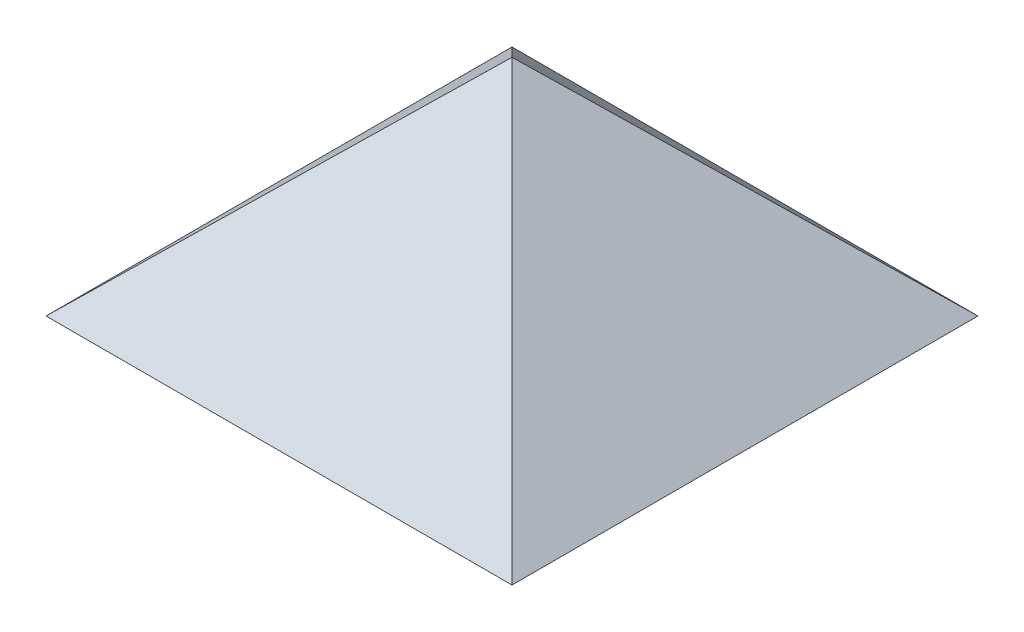
ISO-10303-21;
HEADER;
FILE_DESCRIPTION(('STEP AP214'),'2;1');
FILE_NAME('part.step','',(''),(''),'','','');
FILE_SCHEMA(('AUTOMOTIVE_DESIGN { 1 0 10303 214 1 1 1 1 }'));
ENDSEC;
DATA;
#1=APPLICATION_CONTEXT('core data for automotive mechanical design processes');
#2=APPLICATION_PROTOCOL_DEFINITION('international standard','automotive_design',2000,#1);
#3=PRODUCT_CONTEXT('',#1,'mechanical');
#4=PRODUCT('Part','Part','',(#3));
#5=PRODUCT_RELATED_PRODUCT_CATEGORY('part','',(#4));
#6=PRODUCT_DEFINITION_FORMATION('','',#4);
#7=PRODUCT_DEFINITION_CONTEXT('part definition',#1,'design');
#8=PRODUCT_DEFINITION('design','',#6,#7);
#9=PRODUCT_DEFINITION_SHAPE('','',#8);
#10=(LENGTH_UNIT() NAMED_UNIT(*) SI_UNIT(.MILLI.,.METRE.));
#11=(NAMED_UNIT(*) PLANE_ANGLE_UNIT() SI_UNIT($,.RADIAN.));
#12=(NAMED_UNIT(*) SI_UNIT($,.STERADIAN.) SOLID_ANGLE_UNIT());
#13=UNCERTAINTY_MEASURE_WITH_UNIT(LENGTH_MEASURE(1.E-05),#10,'distance_accuracy_value','');
#14=(GEOMETRIC_REPRESENTATION_CONTEXT(3) GLOBAL_UNCERTAINTY_ASSIGNED_CONTEXT((#13)) GLOBAL_UNIT_ASSIGNED_CONTEXT((#10,
#11,#12)) REPRESENTATION_CONTEXT('',''));
#15=CARTESIAN_POINT('',(0.,0.,0.));
#16=DIRECTION('',(0.,0.,1.));
#17=DIRECTION('',(1.,0.,0.));
#18=AXIS2_PLACEMENT_3D('',#15,#16,#17);
#19=CARTESIAN_POINT('',(624.519600307456,649.500384319754,-3.69052085842322E-13));
#20=DIRECTION('',(0.693108716251784,0.720833064901856,0.));
#21=DIRECTION('',(-0.720833064901856,0.693108716251785,0.));
#22=AXIS2_PLACEMENT_3D('',#19,#20,#21);
#23=PLANE('',#22);
#24=DIRECTION('',(0.584749707598187,-0.562259334229027,-0.584749707598188));
#25=VECTOR('',#24,1.);
#26=CARTESIAN_POINT('',(0.,1250.,0.));
#27=LINE('',#26,#25);
#28=CARTESIAN_POINT('',(0.,1250.,0.));
#29=VERTEX_POINT('',#28);
#30=CARTESIAN_POINT('',(1300.,0.,-1300.));
#31=VERTEX_POINT('',#30);
#32=EDGE_CURVE('E168',#29,#31,#27,.T.);
#33=ORIENTED_EDGE('',*,*,#32,.F.);
#34=DIRECTION('',(-0.584749707598188,0.562259334229026,-0.584749707598188));
#35=VECTOR('',#34,1.);
#36=CARTESIAN_POINT('',(0.,1250.,0.));
#37=LINE('',#36,#35);
#38=CARTESIAN_POINT('',(1300.,4.44089209850063E-13,1300.));
#39=VERTEX_POINT('',#38);
#40=EDGE_CURVE('E13',#39,#29,#37,.T.);
#41=ORIENTED_EDGE('',*,*,#40,.F.);
#42=DIRECTION('',(0.,0.,1.));
#43=VECTOR('',#42,1.);
#44=CARTESIAN_POINT('',(1300.,0.,-1300.));
#45=LINE('',#44,#43);
#46=EDGE_CURVE('E82',#31,#39,#45,.T.);
#47=ORIENTED_EDGE('',*,*,#46,.F.);
#48=EDGE_LOOP('',(#33,#41,#47));
#49=FACE_BOUND('',#48,.T.);
#50=ADVANCED_FACE('F72',(#49),#23,.T.);
#51=CARTESIAN_POINT('',(583.279479338394,606.61065851193,-2.46201249697577E-13));
#52=DIRECTION('',(0.693108716251785,0.720833064901856,0.));
#53=DIRECTION('',(-0.720833064901856,0.693108716251785,0.));
#54=AXIS2_PLACEMENT_3D('',#51,#52,#53);
#55=PLANE('',#54);
#56=DIRECTION('',(0.584749707598187,-0.562259334229027,-0.584749707598188));
#57=VECTOR('',#56,1.);
#58=CARTESIAN_POINT('',(0.,1167.45631172192,0.));
#59=LINE('',#58,#57);
#60=CARTESIAN_POINT('',(0.,1167.45631172192,0.));
#61=VERTEX_POINT('',#60);
#62=CARTESIAN_POINT('',(1214.1545641908,2.22044604925031E-13,-1214.1545641908));
#63=VERTEX_POINT('',#62);
#64=EDGE_CURVE('E131',#61,#63,#59,.T.);
#65=ORIENTED_EDGE('',*,*,#64,.T.);
#66=DIRECTION('',(0.,0.,1.));
#67=VECTOR('',#66,1.);
#68=CARTESIAN_POINT('',(1214.1545641908,1.11022302462516E-13,1214.1545641908));
#69=LINE('',#68,#67);
#70=CARTESIAN_POINT('',(1214.1545641908,0.,1214.1545641908));
#71=VERTEX_POINT('',#70);
#72=EDGE_CURVE('E115',#63,#71,#69,.T.);
#73=ORIENTED_EDGE('',*,*,#72,.T.);
#74=DIRECTION('',(-0.584749707598188,0.562259334229027,-0.584749707598187));
#75=VECTOR('',#74,1.);
#76=CARTESIAN_POINT('',(0.,1167.45631172192,0.));
#77=LINE('',#76,#75);
#78=EDGE_CURVE('E120',#71,#61,#77,.T.);
#79=ORIENTED_EDGE('',*,*,#78,.T.);
#80=EDGE_LOOP('',(#65,#73,#79));
#81=FACE_BOUND('',#80,.T.);
#82=ADVANCED_FACE('F130',(#81),#55,.F.);
#83=CARTESIAN_POINT('',(0.,0.,0.));
#84=DIRECTION('',(-0.707106781186548,0.,0.707106781186547));
#85=DIRECTION('',(0.707106781186547,0.,0.707106781186548));
#86=AXIS2_PLACEMENT_3D('',#83,#84,#85);
#87=PLANE('',#86);
#88=DIRECTION('',(0.707106781186547,0.,0.707106781186548));
#89=VECTOR('',#88,1.);
#90=CARTESIAN_POINT('',(1214.1545641908,0.,1214.1545641908));
#91=LINE('',#90,#89);
#92=EDGE_CURVE('E110',#71,#39,#91,.T.);
#93=ORIENTED_EDGE('',*,*,#92,.T.);
#94=ORIENTED_EDGE('',*,*,#40,.T.);
#95=DIRECTION('',(0.,1.,0.));
#96=VECTOR('',#95,1.);
#97=CARTESIAN_POINT('',(0.,1167.45631172192,0.));
#98=LINE('',#97,#96);
#99=EDGE_CURVE('E97',#61,#29,#98,.T.);
#100=ORIENTED_EDGE('',*,*,#99,.F.);
#101=ORIENTED_EDGE('',*,*,#78,.F.);
#102=EDGE_LOOP('',(#93,#94,#100,#101));
#103=FACE_BOUND('',#102,.T.);
#104=ADVANCED_FACE('F123',(#103),#87,.T.);
#105=CARTESIAN_POINT('',(-2.22044604925031E-13,0.,-2.22044604925031E-13));
#106=DIRECTION('',(-0.707106781186548,0.,-0.707106781186548));
#107=DIRECTION('',(-0.707106781186548,0.,0.707106781186548));
#108=AXIS2_PLACEMENT_3D('',#105,#106,#107);
#109=PLANE('',#108);
#110=ORIENTED_EDGE('',*,*,#99,.T.);
#111=ORIENTED_EDGE('',*,*,#32,.T.);
#112=DIRECTION('',(0.707106781186548,0.,-0.707106781186548));
#113=VECTOR('',#112,1.);
#114=CARTESIAN_POINT('',(1214.1545641908,2.22044604925031E-13,-1214.1545641908));
#115=LINE('',#114,#113);
#116=EDGE_CURVE('E184',#63,#31,#115,.T.);
#117=ORIENTED_EDGE('',*,*,#116,.F.);
#118=ORIENTED_EDGE('',*,*,#64,.F.);
#119=EDGE_LOOP('',(#110,#111,#117,#118));
#120=FACE_BOUND('',#119,.T.);
#121=ADVANCED_FACE('F198',(#120),#109,.T.);
#122=CARTESIAN_POINT('',(0.,-6.28097389179493E-12,0.));
#123=DIRECTION('',(0.,-1.,0.));
#124=DIRECTION('',(0.,0.,-1.));
#125=AXIS2_PLACEMENT_3D('',#122,#123,#124);
#126=PLANE('',#125);
#127=ORIENTED_EDGE('',*,*,#116,.T.);
#128=ORIENTED_EDGE('',*,*,#46,.T.);
#129=ORIENTED_EDGE('',*,*,#92,.F.);
#130=ORIENTED_EDGE('',*,*,#72,.F.);
#131=EDGE_LOOP('',(#127,#128,#129,#130));
#132=FACE_BOUND('',#131,.T.);
#133=ADVANCED_FACE('F113',(#132),#126,.T.);
#134=CLOSED_SHELL('',(#50,#82,#104,#121,#133));
#135=MANIFOLD_SOLID_BREP('B2',#134);
#136=CARTESIAN_POINT('',(-2.63608632744516E-13,649.500384319754,-624.519600307456));
#137=DIRECTION('',(0.,-0.720833064901856,0.693108716251784));
#138=DIRECTION('',(0.,-0.693108716251784,-0.720833064901856));
#139=AXIS2_PLACEMENT_3D('',#136,#137,#138);
#140=PLANE('',#139);
#141=DIRECTION('',(0.584749707598187,-0.562259334229027,-0.584749707598188));
#142=VECTOR('',#141,1.);
#143=CARTESIAN_POINT('',(0.,1250.,0.));
#144=LINE('',#143,#142);
#145=CARTESIAN_POINT('',(0.,1250.,0.));
#146=VERTEX_POINT('',#145);
#147=CARTESIAN_POINT('',(1300.,4.44089209850063E-13,-1300.));
#148=VERTEX_POINT('',#147);
#149=EDGE_CURVE('E380',#146,#148,#144,.T.);
#150=ORIENTED_EDGE('',*,*,#149,.T.);
#151=DIRECTION('',(-1.,0.,0.));
#152=VECTOR('',#151,1.);
#153=CARTESIAN_POINT('',(-1300.,0.,-1300.));
#154=LINE('',#153,#152);
#155=CARTESIAN_POINT('',(-1300.,2.22044604925031E-13,-1300.));
#156=VERTEX_POINT('',#155);
#157=EDGE_CURVE('E327',#148,#156,#154,.T.);
#158=ORIENTED_EDGE('',*,*,#157,.T.);
#159=DIRECTION('',(0.584749707598188,0.562259334229027,0.584749707598187));
#160=VECTOR('',#159,1.);
#161=CARTESIAN_POINT('',(0.,1250.,0.));
#162=LINE('',#161,#160);
#163=EDGE_CURVE('E70',#156,#146,#162,.T.);
#164=ORIENTED_EDGE('',*,*,#163,.T.);
#165=EDGE_LOOP('',(#150,#158,#164));
#166=FACE_BOUND('',#165,.T.);
#167=ADVANCED_FACE('F317',(#166),#140,.F.);
#168=CARTESIAN_POINT('',(-1.96960999758062E-13,606.61065851193,-583.279479338394));
#169=DIRECTION('',(0.,-0.720833064901856,0.693108716251784));
#170=DIRECTION('',(0.,-0.693108716251784,-0.720833064901856));
#171=AXIS2_PLACEMENT_3D('',#168,#169,#170);
#172=PLANE('',#171);
#173=DIRECTION('',(0.584749707598187,-0.562259334229027,-0.584749707598188));
#174=VECTOR('',#173,1.);
#175=CARTESIAN_POINT('',(0.,1167.45631172192,0.));
#176=LINE('',#175,#174);
#177=CARTESIAN_POINT('',(0.,1167.45631172192,0.));
#178=VERTEX_POINT('',#177);
#179=CARTESIAN_POINT('',(1214.1545641908,7.77156117237609E-13,-1214.1545641908));
#180=VERTEX_POINT('',#179);
#181=EDGE_CURVE('E362',#178,#180,#176,.T.);
#182=ORIENTED_EDGE('',*,*,#181,.F.);
#183=DIRECTION('',(0.584749707598188,0.562259334229027,0.584749707598187));
#184=VECTOR('',#183,1.);
#185=CARTESIAN_POINT('',(0.,1167.45631172192,0.));
#186=LINE('',#185,#184);
#187=CARTESIAN_POINT('',(-1214.1545641908,0.,-1214.1545641908));
#188=VERTEX_POINT('',#187);
#189=EDGE_CURVE('E356',#188,#178,#186,.T.);
#190=ORIENTED_EDGE('',*,*,#189,.F.);
#191=DIRECTION('',(-1.,0.,0.));
#192=VECTOR('',#191,1.);
#193=CARTESIAN_POINT('',(1214.1545641908,7.7715611723761E-13,-1214.1545641908));
#194=LINE('',#193,#192);
#195=EDGE_CURVE('E359',#180,#188,#194,.T.);
#196=ORIENTED_EDGE('',*,*,#195,.F.);
#197=EDGE_LOOP('',(#182,#190,#196));
#198=FACE_BOUND('',#197,.T.);
#199=ADVANCED_FACE('F358',(#198),#172,.T.);
#200=CARTESIAN_POINT('',(0.,0.,0.));
#201=DIRECTION('',(0.707106781186543,0.,0.707106781186552));
#202=DIRECTION('',(0.707106781186552,0.,-0.707106781186543));
#203=AXIS2_PLACEMENT_3D('',#200,#201,#202);
#204=PLANE('',#203);
#205=DIRECTION('',(0.707106781186552,0.,-0.707106781186543));
#206=VECTOR('',#205,1.);
#207=CARTESIAN_POINT('',(1214.1545641908,7.77156117237609E-13,-1214.1545641908));
#208=LINE('',#207,#206);
#209=EDGE_CURVE('E367',#180,#148,#208,.T.);
#210=ORIENTED_EDGE('',*,*,#209,.T.);
#211=ORIENTED_EDGE('',*,*,#149,.F.);
#212=DIRECTION('',(0.,1.,0.));
#213=VECTOR('',#212,1.);
#214=CARTESIAN_POINT('',(0.,1167.45631172192,0.));
#215=LINE('',#214,#213);
#216=EDGE_CURVE('E381',#178,#146,#215,.T.);
#217=ORIENTED_EDGE('',*,*,#216,.F.);
#218=ORIENTED_EDGE('',*,*,#181,.T.);
#219=EDGE_LOOP('',(#210,#211,#217,#218));
#220=FACE_BOUND('',#219,.T.);
#221=ADVANCED_FACE('F400',(#220),#204,.T.);
#222=CARTESIAN_POINT('',(-2.22044604925031E-13,0.,2.22044604925031E-13));
#223=DIRECTION('',(-0.707106781186548,0.,0.707106781186548));
#224=DIRECTION('',(0.707106781186548,0.,0.707106781186548));
#225=AXIS2_PLACEMENT_3D('',#222,#223,#224);
#226=PLANE('',#225);
#227=ORIENTED_EDGE('',*,*,#216,.T.);
#228=ORIENTED_EDGE('',*,*,#163,.F.);
#229=DIRECTION('',(-0.707106781186548,0.,-0.707106781186548));
#230=VECTOR('',#229,1.);
#231=CARTESIAN_POINT('',(-1214.1545641908,0.,-1214.1545641908));
#232=LINE('',#231,#230);
#233=EDGE_CURVE('E342',#188,#156,#232,.T.);
#234=ORIENTED_EDGE('',*,*,#233,.F.);
#235=ORIENTED_EDGE('',*,*,#189,.T.);
#236=EDGE_LOOP('',(#227,#228,#234,#235));
#237=FACE_BOUND('',#236,.T.);
#238=ADVANCED_FACE('F378',(#237),#226,.T.);
#239=CARTESIAN_POINT('',(0.,1.17688604278788E-11,0.));
#240=DIRECTION('',(0.,-1.,0.));
#241=DIRECTION('',(1.,0.,0.));
#242=AXIS2_PLACEMENT_3D('',#239,#240,#241);
#243=PLANE('',#242);
#244=ORIENTED_EDGE('',*,*,#233,.T.);
#245=ORIENTED_EDGE('',*,*,#157,.F.);
#246=ORIENTED_EDGE('',*,*,#209,.F.);
#247=ORIENTED_EDGE('',*,*,#195,.T.);
#248=EDGE_LOOP('',(#244,#245,#246,#247));
#249=FACE_BOUND('',#248,.T.);
#250=ADVANCED_FACE('F373',(#249),#243,.T.);
#251=CLOSED_SHELL('',(#167,#199,#221,#238,#250));
#252=MANIFOLD_SOLID_BREP('B7',#251);
#253=CARTESIAN_POINT('',(-624.519600307456,649.500384319754,2.63608632744516E-13));
#254=DIRECTION('',(0.693108716251785,-0.720833064901856,0.));
#255=DIRECTION('',(0.720833064901856,0.693108716251785,0.));
#256=AXIS2_PLACEMENT_3D('',#253,#254,#255);
#257=PLANE('',#256);
#258=DIRECTION('',(0.584749707598188,0.562259334229027,0.584749707598187));
#259=VECTOR('',#258,1.);
#260=CARTESIAN_POINT('',(0.,1250.,0.));
#261=LINE('',#260,#259);
#262=CARTESIAN_POINT('',(-1300.,0.,-1300.));
#263=VERTEX_POINT('',#262);
#264=CARTESIAN_POINT('',(0.,1250.,0.));
#265=VERTEX_POINT('',#264);
#266=EDGE_CURVE('E625',#263,#265,#261,.T.);
#267=ORIENTED_EDGE('',*,*,#266,.F.);
#268=DIRECTION('',(0.,0.,-1.));
#269=VECTOR('',#268,1.);
#270=CARTESIAN_POINT('',(-1300.,0.,-1300.));
#271=LINE('',#270,#269);
#272=CARTESIAN_POINT('',(-1300.,0.,1300.));
#273=VERTEX_POINT('',#272);
#274=EDGE_CURVE('E315',#273,#263,#271,.T.);
#275=ORIENTED_EDGE('',*,*,#274,.F.);
#276=DIRECTION('',(-0.584749707598187,-0.562259334229027,0.584749707598188));
#277=VECTOR('',#276,1.);
#278=CARTESIAN_POINT('',(0.,1250.,0.));
#279=LINE('',#278,#277);
#280=EDGE_CURVE('E571',#265,#273,#279,.T.);
#281=ORIENTED_EDGE('',*,*,#280,.F.);
#282=EDGE_LOOP('',(#267,#275,#281));
#283=FACE_BOUND('',#282,.T.);
#284=ADVANCED_FACE('F561',(#283),#257,.F.);
#285=CARTESIAN_POINT('',(-583.279479338394,606.61065851193,2.46201249697577E-13));
#286=DIRECTION('',(0.693108716251785,-0.720833064901856,0.));
#287=DIRECTION('',(0.720833064901856,0.693108716251785,0.));
#288=AXIS2_PLACEMENT_3D('',#285,#286,#287);
#289=PLANE('',#288);
#290=DIRECTION('',(-0.584749707598188,-0.562259334229027,-0.584749707598187));
#291=VECTOR('',#290,1.);
#292=CARTESIAN_POINT('',(0.,1167.45631172192,0.));
#293=LINE('',#292,#291);
#294=CARTESIAN_POINT('',(-2.22044604925031E-13,1167.45631172192,2.22044604925031E-13));
#295=VERTEX_POINT('',#294);
#296=CARTESIAN_POINT('',(-1214.1545641908,-1.11022302462516E-13,-1214.1545641908));
#297=VERTEX_POINT('',#296);
#298=EDGE_CURVE('E606',#295,#297,#293,.T.);
#299=ORIENTED_EDGE('',*,*,#298,.F.);
#300=DIRECTION('',(0.584749707598187,0.562259334229027,-0.584749707598188));
#301=VECTOR('',#300,1.);
#302=CARTESIAN_POINT('',(-1214.1545641908,0.,1214.1545641908));
#303=LINE('',#302,#301);
#304=CARTESIAN_POINT('',(-1214.1545641908,0.,1214.1545641908));
#305=VERTEX_POINT('',#304);
#306=EDGE_CURVE('E600',#305,#295,#303,.T.);
#307=ORIENTED_EDGE('',*,*,#306,.F.);
#308=DIRECTION('',(0.,0.,1.));
#309=VECTOR('',#308,1.);
#310=CARTESIAN_POINT('',(-1214.1545641908,-1.11022302462516E-13,-1214.1545641908));
#311=LINE('',#310,#309);
#312=EDGE_CURVE('E604',#297,#305,#311,.T.);
#313=ORIENTED_EDGE('',*,*,#312,.F.);
#314=EDGE_LOOP('',(#299,#307,#313));
#315=FACE_BOUND('',#314,.T.);
#316=ADVANCED_FACE('F603',(#315),#289,.T.);
#317=CARTESIAN_POINT('',(-3.45932946020533E-12,0.,3.45932946020532E-12));
#318=DIRECTION('',(0.707106781186548,0.,-0.707106781186547));
#319=DIRECTION('',(-0.707106781186547,0.,-0.707106781186548));
#320=AXIS2_PLACEMENT_3D('',#317,#318,#319);
#321=PLANE('',#320);
#322=DIRECTION('',(-0.707106781186547,0.,-0.707106781186548));
#323=VECTOR('',#322,1.);
#324=CARTESIAN_POINT('',(-1214.1545641908,-1.11022302462516E-13,-1214.1545641908));
#325=LINE('',#324,#323);
#326=EDGE_CURVE('E586',#297,#263,#325,.T.);
#327=ORIENTED_EDGE('',*,*,#326,.T.);
#328=ORIENTED_EDGE('',*,*,#266,.T.);
#329=DIRECTION('',(0.,1.,0.));
#330=VECTOR('',#329,1.);
#331=CARTESIAN_POINT('',(-2.22044604925031E-13,1167.45631172192,2.22044604925031E-13));
#332=LINE('',#331,#330);
#333=EDGE_CURVE('E626',#295,#265,#332,.T.);
#334=ORIENTED_EDGE('',*,*,#333,.F.);
#335=ORIENTED_EDGE('',*,*,#298,.T.);
#336=EDGE_LOOP('',(#327,#328,#334,#335));
#337=FACE_BOUND('',#336,.T.);
#338=ADVANCED_FACE('F644',(#337),#321,.T.);
#339=CARTESIAN_POINT('',(2.22044604925031E-12,0.,2.22044604925032E-12));
#340=DIRECTION('',(0.707106781186547,0.,0.707106781186548));
#341=DIRECTION('',(0.707106781186548,0.,-0.707106781186547));
#342=AXIS2_PLACEMENT_3D('',#339,#340,#341);
#343=PLANE('',#342);
#344=ORIENTED_EDGE('',*,*,#333,.T.);
#345=ORIENTED_EDGE('',*,*,#280,.T.);
#346=DIRECTION('',(-0.707106781186548,0.,0.707106781186547));
#347=VECTOR('',#346,1.);
#348=CARTESIAN_POINT('',(-1214.1545641908,0.,1214.1545641908));
#349=LINE('',#348,#347);
#350=EDGE_CURVE('E619',#305,#273,#349,.T.);
#351=ORIENTED_EDGE('',*,*,#350,.F.);
#352=ORIENTED_EDGE('',*,*,#306,.T.);
#353=EDGE_LOOP('',(#344,#345,#351,#352));
#354=FACE_BOUND('',#353,.T.);
#355=ADVANCED_FACE('F623',(#354),#343,.T.);
#356=CARTESIAN_POINT('',(0.,-1.68126577541126E-12,0.));
#357=DIRECTION('',(0.,-1.,0.));
#358=DIRECTION('',(0.,0.,-1.));
#359=AXIS2_PLACEMENT_3D('',#356,#357,#358);
#360=PLANE('',#359);
#361=ORIENTED_EDGE('',*,*,#350,.T.);
#362=ORIENTED_EDGE('',*,*,#274,.T.);
#363=ORIENTED_EDGE('',*,*,#326,.F.);
#364=ORIENTED_EDGE('',*,*,#312,.T.);
#365=EDGE_LOOP('',(#361,#362,#363,#364));
#366=FACE_BOUND('',#365,.T.);
#367=ADVANCED_FACE('F618',(#366),#360,.T.);
#368=CLOSED_SHELL('',(#284,#316,#338,#355,#367));
#369=MANIFOLD_SOLID_BREP('B64',#368);
#370=CARTESIAN_POINT('',(1.96960999758062E-13,606.61065851193,583.279479338394));
#371=DIRECTION('',(0.,-0.720833064901856,-0.693108716251784));
#372=DIRECTION('',(0.,0.693108716251784,-0.720833064901856));
#373=AXIS2_PLACEMENT_3D('',#370,#371,#372);
#374=PLANE('',#373);
#375=DIRECTION('',(0.584749707598187,0.562259334229027,-0.584749707598188));
#376=VECTOR('',#375,1.);
#377=CARTESIAN_POINT('',(-1214.1545641908,0.,1214.1545641908));
#378=LINE('',#377,#376);
#379=CARTESIAN_POINT('',(-1214.1545641908,0.,1214.1545641908));
#380=VERTEX_POINT('',#379);
#381=CARTESIAN_POINT('',(0.,1167.45631172192,0.));
#382=VERTEX_POINT('',#381);
#383=EDGE_CURVE('E894',#380,#382,#378,.T.);
#384=ORIENTED_EDGE('',*,*,#383,.T.);
#385=DIRECTION('',(0.584749707598188,-0.562259334229027,0.584749707598187));
#386=VECTOR('',#385,1.);
#387=CARTESIAN_POINT('',(0.,1167.45631172192,0.));
#388=LINE('',#387,#386);
#389=CARTESIAN_POINT('',(1214.1545641908,0.,1214.1545641908));
#390=VERTEX_POINT('',#389);
#391=EDGE_CURVE('E806',#382,#390,#388,.T.);
#392=ORIENTED_EDGE('',*,*,#391,.T.);
#393=DIRECTION('',(-1.,0.,0.));
#394=VECTOR('',#393,1.);
#395=CARTESIAN_POINT('',(-1214.1545641908,0.,1214.1545641908));
#396=LINE('',#395,#394);
#397=EDGE_CURVE('E559',#390,#380,#396,.T.);
#398=ORIENTED_EDGE('',*,*,#397,.T.);
#399=EDGE_LOOP('',(#384,#392,#398));
#400=FACE_BOUND('',#399,.T.);
#401=ADVANCED_FACE('F796',(#400),#374,.T.);
#402=CARTESIAN_POINT('',(1.05443453097806E-13,649.500384319754,624.519600307456));
#403=DIRECTION('',(0.,-0.720833064901856,-0.693108716251784));
#404=DIRECTION('',(0.,0.693108716251784,-0.720833064901856));
#405=AXIS2_PLACEMENT_3D('',#402,#403,#404);
#406=PLANE('',#405);
#407=DIRECTION('',(-0.584749707598187,-0.562259334229027,0.584749707598188));
#408=VECTOR('',#407,1.);
#409=CARTESIAN_POINT('',(0.,1250.,0.));
#410=LINE('',#409,#408);
#411=CARTESIAN_POINT('',(0.,1250.,0.));
#412=VERTEX_POINT('',#411);
#413=CARTESIAN_POINT('',(-1300.,0.,1300.));
#414=VERTEX_POINT('',#413);
#415=EDGE_CURVE('E854',#412,#414,#410,.T.);
#416=ORIENTED_EDGE('',*,*,#415,.T.);
#417=DIRECTION('',(1.,0.,0.));
#418=VECTOR('',#417,1.);
#419=CARTESIAN_POINT('',(-1300.,0.,1300.));
#420=LINE('',#419,#418);
#421=CARTESIAN_POINT('',(1300.,4.44089209850063E-13,1300.));
#422=VERTEX_POINT('',#421);
#423=EDGE_CURVE('E835',#414,#422,#420,.T.);
#424=ORIENTED_EDGE('',*,*,#423,.T.);
#425=DIRECTION('',(-0.584749707598188,0.562259334229026,-0.584749707598188));
#426=VECTOR('',#425,1.);
#427=CARTESIAN_POINT('',(0.,1250.,0.));
#428=LINE('',#427,#426);
#429=EDGE_CURVE('E840',#422,#412,#428,.T.);
#430=ORIENTED_EDGE('',*,*,#429,.T.);
#431=EDGE_LOOP('',(#416,#424,#430));
#432=FACE_BOUND('',#431,.T.);
#433=ADVANCED_FACE('F853',(#432),#406,.F.);
#434=CARTESIAN_POINT('',(0.,0.,0.));
#435=DIRECTION('',(-0.707106781186549,0.,0.707106781186546));
#436=DIRECTION('',(0.707106781186546,0.,0.707106781186549));
#437=AXIS2_PLACEMENT_3D('',#434,#435,#436);
#438=PLANE('',#437);
#439=DIRECTION('',(-0.707106781186546,0.,-0.707106781186549));
#440=VECTOR('',#439,1.);
#441=CARTESIAN_POINT('',(1300.,4.44089209850063E-13,1300.));
#442=LINE('',#441,#440);
#443=EDGE_CURVE('E821',#422,#390,#442,.T.);
#444=ORIENTED_EDGE('',*,*,#443,.T.);
#445=ORIENTED_EDGE('',*,*,#391,.F.);
#446=DIRECTION('',(0.,-1.,0.));
#447=VECTOR('',#446,1.);
#448=CARTESIAN_POINT('',(0.,1250.,0.));
#449=LINE('',#448,#447);
#450=EDGE_CURVE('E839',#412,#382,#449,.T.);
#451=ORIENTED_EDGE('',*,*,#450,.F.);
#452=ORIENTED_EDGE('',*,*,#429,.F.);
#453=EDGE_LOOP('',(#444,#445,#451,#452));
#454=FACE_BOUND('',#453,.T.);
#455=ADVANCED_FACE('F844',(#454),#438,.F.);
#456=CARTESIAN_POINT('',(-4.55191440096316E-12,0.,-4.55191440096312E-12));
#457=DIRECTION('',(0.70710678118655,0.,0.707106781186545));
#458=DIRECTION('',(0.707106781186545,0.,-0.70710678118655));
#459=AXIS2_PLACEMENT_3D('',#456,#457,#458);
#460=PLANE('',#459);
#461=ORIENTED_EDGE('',*,*,#450,.T.);
#462=ORIENTED_EDGE('',*,*,#383,.F.);
#463=DIRECTION('',(0.707106781186545,0.,-0.70710678118655));
#464=VECTOR('',#463,1.);
#465=CARTESIAN_POINT('',(-1300.,0.,1300.));
#466=LINE('',#465,#464);
#467=EDGE_CURVE('E900',#414,#380,#466,.T.);
#468=ORIENTED_EDGE('',*,*,#467,.F.);
#469=ORIENTED_EDGE('',*,*,#415,.F.);
#470=EDGE_LOOP('',(#461,#462,#468,#469));
#471=FACE_BOUND('',#470,.T.);
#472=ADVANCED_FACE('F924',(#471),#460,.F.);
#473=CARTESIAN_POINT('',(0.,-6.28097389179493E-12,0.));
#474=DIRECTION('',(0.,1.,0.));
#475=DIRECTION('',(-1.,0.,0.));
#476=AXIS2_PLACEMENT_3D('',#473,#474,#475);
#477=PLANE('',#476);
#478=ORIENTED_EDGE('',*,*,#467,.T.);
#479=ORIENTED_EDGE('',*,*,#397,.F.);
#480=ORIENTED_EDGE('',*,*,#443,.F.);
#481=ORIENTED_EDGE('',*,*,#423,.F.);
#482=EDGE_LOOP('',(#478,#479,#480,#481));
#483=FACE_BOUND('',#482,.T.);
#484=ADVANCED_FACE('F833',(#483),#477,.F.);
#485=CLOSED_SHELL('',(#401,#433,#455,#472,#484));
#486=MANIFOLD_SOLID_BREP('B309',#485);
#487=ADVANCED_BREP_SHAPE_REPRESENTATION('',(#18,#135,#252,#369,#486),#14);
#488=SHAPE_DEFINITION_REPRESENTATION(#9,#487);
ENDSEC;
END-ISO-10303-21;
